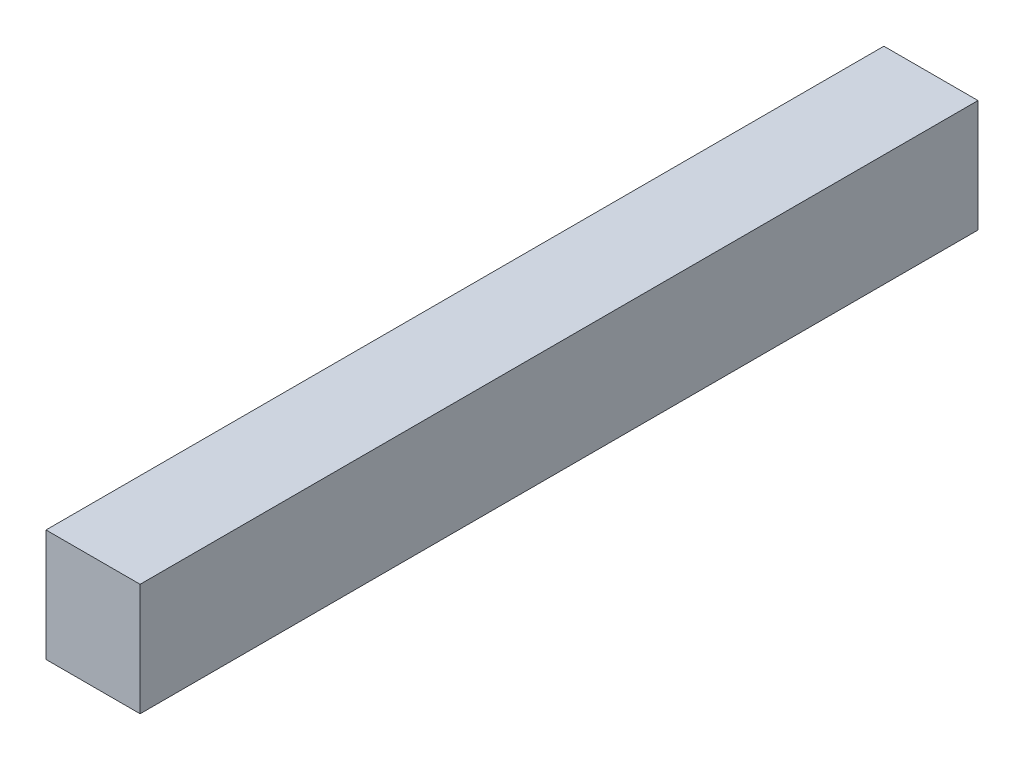
ISO-10303-21;
HEADER;
FILE_DESCRIPTION(('STEP AP214'),'2;1');
FILE_NAME('part.step','',(''),(''),'','','');
FILE_SCHEMA(('AUTOMOTIVE_DESIGN { 1 0 10303 214 1 1 1 1 }'));
ENDSEC;
DATA;
#1=APPLICATION_CONTEXT('core data for automotive mechanical design processes');
#2=APPLICATION_PROTOCOL_DEFINITION('international standard','automotive_design',2000,#1);
#3=PRODUCT_CONTEXT('',#1,'mechanical');
#4=PRODUCT('Part','Part','',(#3));
#5=PRODUCT_RELATED_PRODUCT_CATEGORY('part','',(#4));
#6=PRODUCT_DEFINITION_FORMATION('','',#4);
#7=PRODUCT_DEFINITION_CONTEXT('part definition',#1,'design');
#8=PRODUCT_DEFINITION('design','',#6,#7);
#9=PRODUCT_DEFINITION_SHAPE('','',#8);
#10=(LENGTH_UNIT() NAMED_UNIT(*) SI_UNIT(.MILLI.,.METRE.));
#11=(NAMED_UNIT(*) PLANE_ANGLE_UNIT() SI_UNIT($,.RADIAN.));
#12=(NAMED_UNIT(*) SI_UNIT($,.STERADIAN.) SOLID_ANGLE_UNIT());
#13=UNCERTAINTY_MEASURE_WITH_UNIT(LENGTH_MEASURE(1.E-05),#10,'distance_accuracy_value','');
#14=(GEOMETRIC_REPRESENTATION_CONTEXT(3) GLOBAL_UNCERTAINTY_ASSIGNED_CONTEXT((#13)) GLOBAL_UNIT_ASSIGNED_CONTEXT((#10,
#11,#12)) REPRESENTATION_CONTEXT('',''));
#15=CARTESIAN_POINT('',(0.,0.,0.));
#16=DIRECTION('',(0.,0.,1.));
#17=DIRECTION('',(1.,0.,0.));
#18=AXIS2_PLACEMENT_3D('',#15,#16,#17);
#19=CARTESIAN_POINT('',(0.547938125008194,-0.55852723906169,0.));
#20=DIRECTION('',(-1.,0.,0.));
#21=DIRECTION('',(0.,-1.,0.));
#22=AXIS2_PLACEMENT_3D('',#19,#20,#21);
#23=PLANE('',#22);
#24=DIRECTION('',(0.,1.,0.));
#25=VECTOR('',#24,1.);
#26=CARTESIAN_POINT('',(0.547938125008194,-0.571914597659679,0.));
#27=LINE('',#26,#25);
#28=CARTESIAN_POINT('',(0.547938125008194,-0.571914597659679,0.));
#29=VERTEX_POINT('',#28);
#30=CARTESIAN_POINT('',(0.547938125008194,-0.55852723906169,0.));
#31=VERTEX_POINT('',#30);
#32=EDGE_CURVE('E11',#29,#31,#27,.T.);
#33=ORIENTED_EDGE('',*,*,#32,.F.);
#34=DIRECTION('',(0.,0.,1.));
#35=VECTOR('',#34,1.);
#36=CARTESIAN_POINT('',(0.547938125008194,-0.571914597659679,0.));
#37=LINE('',#36,#35);
#38=CARTESIAN_POINT('',(0.547938125008194,-0.571914597659679,0.1));
#39=VERTEX_POINT('',#38);
#40=EDGE_CURVE('E88',#29,#39,#37,.T.);
#41=ORIENTED_EDGE('',*,*,#40,.T.);
#42=DIRECTION('',(0.,-1.,0.));
#43=VECTOR('',#42,1.);
#44=CARTESIAN_POINT('',(0.547938125008194,-0.55852723906169,0.1));
#45=LINE('',#44,#43);
#46=CARTESIAN_POINT('',(0.547938125008194,-0.55852723906169,0.1));
#47=VERTEX_POINT('',#46);
#48=EDGE_CURVE('E77',#47,#39,#45,.T.);
#49=ORIENTED_EDGE('',*,*,#48,.F.);
#50=DIRECTION('',(0.,0.,1.));
#51=VECTOR('',#50,1.);
#52=CARTESIAN_POINT('',(0.547938125008194,-0.55852723906169,0.));
#53=LINE('',#52,#51);
#54=EDGE_CURVE('E84',#31,#47,#53,.T.);
#55=ORIENTED_EDGE('',*,*,#54,.F.);
#56=EDGE_LOOP('',(#33,#41,#49,#55));
#57=FACE_BOUND('',#56,.T.);
#58=ADVANCED_FACE('F17',(#57),#23,.T.);
#59=CARTESIAN_POINT('',(0.559169891967524,-0.55852723906169,0.));
#60=DIRECTION('',(0.,1.,0.));
#61=DIRECTION('',(-1.,0.,0.));
#62=AXIS2_PLACEMENT_3D('',#59,#60,#61);
#63=PLANE('',#62);
#64=DIRECTION('',(1.,0.,0.));
#65=VECTOR('',#64,1.);
#66=CARTESIAN_POINT('',(0.547938125008194,-0.55852723906169,0.));
#67=LINE('',#66,#65);
#68=CARTESIAN_POINT('',(0.559169891967524,-0.55852723906169,0.));
#69=VERTEX_POINT('',#68);
#70=EDGE_CURVE('E24',#31,#69,#67,.T.);
#71=ORIENTED_EDGE('',*,*,#70,.F.);
#72=ORIENTED_EDGE('',*,*,#54,.T.);
#73=DIRECTION('',(-1.,0.,0.));
#74=VECTOR('',#73,1.);
#75=CARTESIAN_POINT('',(0.559169891967524,-0.55852723906169,0.1));
#76=LINE('',#75,#74);
#77=CARTESIAN_POINT('',(0.559169891967524,-0.55852723906169,0.1));
#78=VERTEX_POINT('',#77);
#79=EDGE_CURVE('E65',#78,#47,#76,.T.);
#80=ORIENTED_EDGE('',*,*,#79,.F.);
#81=DIRECTION('',(0.,0.,1.));
#82=VECTOR('',#81,1.);
#83=CARTESIAN_POINT('',(0.559169891967524,-0.55852723906169,0.));
#84=LINE('',#83,#82);
#85=EDGE_CURVE('E70',#69,#78,#84,.T.);
#86=ORIENTED_EDGE('',*,*,#85,.F.);
#87=EDGE_LOOP('',(#71,#72,#80,#86));
#88=FACE_BOUND('',#87,.T.);
#89=ADVANCED_FACE('F91',(#88),#63,.T.);
#90=CARTESIAN_POINT('',(0.559169891967524,-0.571914597659679,0.));
#91=DIRECTION('',(1.,0.,0.));
#92=DIRECTION('',(0.,1.,0.));
#93=AXIS2_PLACEMENT_3D('',#90,#91,#92);
#94=PLANE('',#93);
#95=DIRECTION('',(0.,-1.,0.));
#96=VECTOR('',#95,1.);
#97=CARTESIAN_POINT('',(0.559169891967524,-0.55852723906169,0.));
#98=LINE('',#97,#96);
#99=CARTESIAN_POINT('',(0.559169891967524,-0.571914597659679,0.));
#100=VERTEX_POINT('',#99);
#101=EDGE_CURVE('E86',#69,#100,#98,.T.);
#102=ORIENTED_EDGE('',*,*,#101,.F.);
#103=ORIENTED_EDGE('',*,*,#85,.T.);
#104=DIRECTION('',(0.,1.,0.));
#105=VECTOR('',#104,1.);
#106=CARTESIAN_POINT('',(0.559169891967524,-0.571914597659679,0.1));
#107=LINE('',#106,#105);
#108=CARTESIAN_POINT('',(0.559169891967524,-0.571914597659679,0.1));
#109=VERTEX_POINT('',#108);
#110=EDGE_CURVE('E66',#109,#78,#107,.T.);
#111=ORIENTED_EDGE('',*,*,#110,.F.);
#112=DIRECTION('',(0.,0.,1.));
#113=VECTOR('',#112,1.);
#114=CARTESIAN_POINT('',(0.559169891967524,-0.571914597659679,0.));
#115=LINE('',#114,#113);
#116=EDGE_CURVE('E55',#100,#109,#115,.T.);
#117=ORIENTED_EDGE('',*,*,#116,.F.);
#118=EDGE_LOOP('',(#102,#103,#111,#117));
#119=FACE_BOUND('',#118,.T.);
#120=ADVANCED_FACE('F69',(#119),#94,.T.);
#121=CARTESIAN_POINT('',(0.547938125008194,-0.571914597659679,0.));
#122=DIRECTION('',(0.,-1.,0.));
#123=DIRECTION('',(1.,0.,0.));
#124=AXIS2_PLACEMENT_3D('',#121,#122,#123);
#125=PLANE('',#124);
#126=DIRECTION('',(-1.,0.,0.));
#127=VECTOR('',#126,1.);
#128=CARTESIAN_POINT('',(0.559169891967524,-0.571914597659679,0.));
#129=LINE('',#128,#127);
#130=EDGE_CURVE('E62',#100,#29,#129,.T.);
#131=ORIENTED_EDGE('',*,*,#130,.F.);
#132=ORIENTED_EDGE('',*,*,#116,.T.);
#133=DIRECTION('',(1.,0.,0.));
#134=VECTOR('',#133,1.);
#135=CARTESIAN_POINT('',(0.547938125008194,-0.571914597659679,0.1));
#136=LINE('',#135,#134);
#137=EDGE_CURVE('E60',#39,#109,#136,.T.);
#138=ORIENTED_EDGE('',*,*,#137,.F.);
#139=ORIENTED_EDGE('',*,*,#40,.F.);
#140=EDGE_LOOP('',(#131,#132,#138,#139));
#141=FACE_BOUND('',#140,.T.);
#142=ADVANCED_FACE('F57',(#141),#125,.T.);
#143=CARTESIAN_POINT('',(0.553554008487859,-0.565220918360685,0.));
#144=DIRECTION('',(0.,0.,1.));
#145=DIRECTION('',(1.,0.,0.));
#146=AXIS2_PLACEMENT_3D('',#143,#144,#145);
#147=PLANE('',#146);
#148=ORIENTED_EDGE('',*,*,#130,.T.);
#149=ORIENTED_EDGE('',*,*,#32,.T.);
#150=ORIENTED_EDGE('',*,*,#70,.T.);
#151=ORIENTED_EDGE('',*,*,#101,.T.);
#152=EDGE_LOOP('',(#148,#149,#150,#151));
#153=FACE_BOUND('',#152,.T.);
#154=ADVANCED_FACE('F90',(#153),#147,.F.);
#155=CARTESIAN_POINT('',(0.553554008487859,-0.565220918360685,0.1));
#156=DIRECTION('',(0.,0.,1.));
#157=DIRECTION('',(1.,0.,0.));
#158=AXIS2_PLACEMENT_3D('',#155,#156,#157);
#159=PLANE('',#158);
#160=ORIENTED_EDGE('',*,*,#137,.T.);
#161=ORIENTED_EDGE('',*,*,#110,.T.);
#162=ORIENTED_EDGE('',*,*,#79,.T.);
#163=ORIENTED_EDGE('',*,*,#48,.T.);
#164=EDGE_LOOP('',(#160,#161,#162,#163));
#165=FACE_BOUND('',#164,.T.);
#166=ADVANCED_FACE('F75',(#165),#159,.T.);
#167=CLOSED_SHELL('',(#58,#89,#120,#142,#154,#166));
#168=MANIFOLD_SOLID_BREP('B1',#167);
#169=ADVANCED_BREP_SHAPE_REPRESENTATION('',(#18,#168),#14);
#170=SHAPE_DEFINITION_REPRESENTATION(#9,#169);
ENDSEC;
END-ISO-10303-21;
